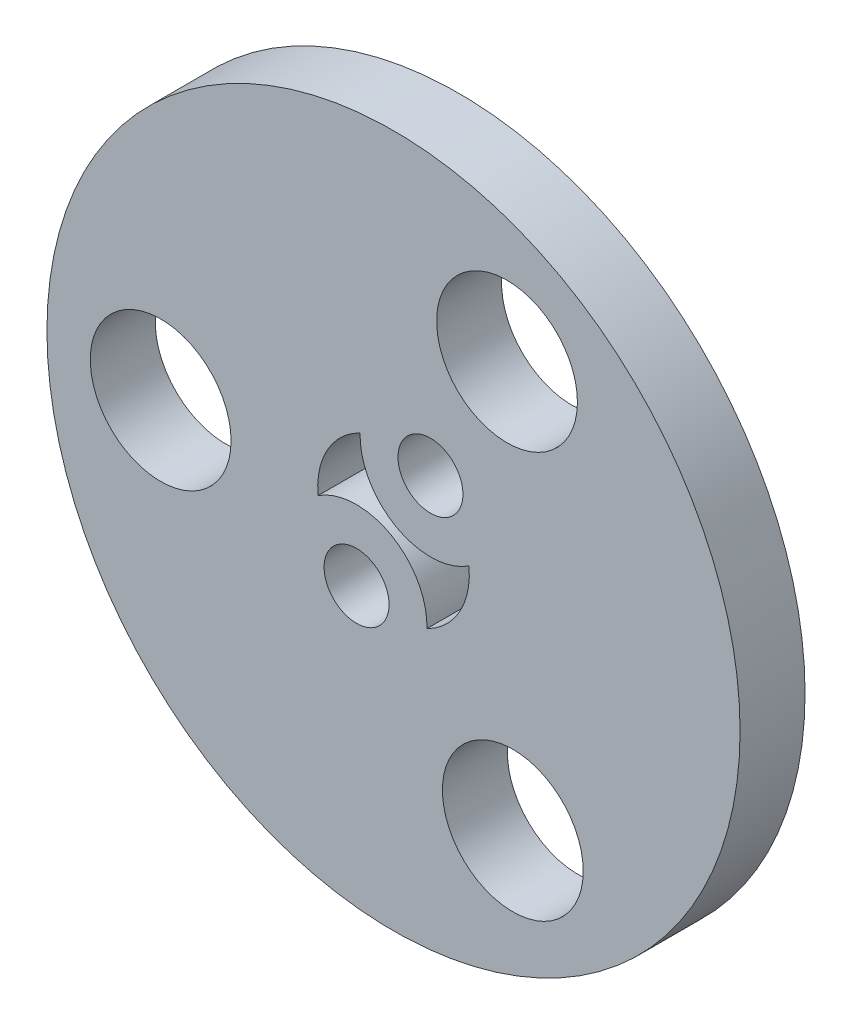
ISO-10303-21;
HEADER;
FILE_DESCRIPTION(('STEP AP214'),'2;1');
FILE_NAME('part.step','',(''),(''),'','','');
FILE_SCHEMA(('AUTOMOTIVE_DESIGN { 1 0 10303 214 1 1 1 1 }'));
ENDSEC;
DATA;
#1=APPLICATION_CONTEXT('core data for automotive mechanical design processes');
#2=APPLICATION_PROTOCOL_DEFINITION('international standard','automotive_design',2000,#1);
#3=PRODUCT_CONTEXT('',#1,'mechanical');
#4=PRODUCT('Part','Part','',(#3));
#5=PRODUCT_RELATED_PRODUCT_CATEGORY('part','',(#4));
#6=PRODUCT_DEFINITION_FORMATION('','',#4);
#7=PRODUCT_DEFINITION_CONTEXT('part definition',#1,'design');
#8=PRODUCT_DEFINITION('design','',#6,#7);
#9=PRODUCT_DEFINITION_SHAPE('','',#8);
#10=(LENGTH_UNIT() NAMED_UNIT(*) SI_UNIT(.MILLI.,.METRE.));
#11=(NAMED_UNIT(*) PLANE_ANGLE_UNIT() SI_UNIT($,.RADIAN.));
#12=(NAMED_UNIT(*) SI_UNIT($,.STERADIAN.) SOLID_ANGLE_UNIT());
#13=UNCERTAINTY_MEASURE_WITH_UNIT(LENGTH_MEASURE(1.E-05),#10,'distance_accuracy_value','');
#14=(GEOMETRIC_REPRESENTATION_CONTEXT(3) GLOBAL_UNCERTAINTY_ASSIGNED_CONTEXT((#13)) GLOBAL_UNIT_ASSIGNED_CONTEXT((#10,
#11,#12)) REPRESENTATION_CONTEXT('',''));
#15=CARTESIAN_POINT('',(0.,0.,0.));
#16=DIRECTION('',(0.,0.,1.));
#17=DIRECTION('',(1.,0.,0.));
#18=AXIS2_PLACEMENT_3D('',#15,#16,#17);
#19=CARTESIAN_POINT('',(0.,0.,3.));
#20=DIRECTION('',(0.,0.,1.));
#21=DIRECTION('',(1.,0.,0.));
#22=AXIS2_PLACEMENT_3D('',#19,#20,#21);
#23=PLANE('',#22);
#24=CARTESIAN_POINT('',(1.70619408974695,3.05596166993511,3.));
#25=DIRECTION('',(0.,0.,1.));
#26=DIRECTION('',(1.,0.,0.));
#27=AXIS2_PLACEMENT_3D('',#24,#25,#26);
#28=CIRCLE('',#27,1.5);
#29=CARTESIAN_POINT('',(3.20619408974695,3.05596166993511,3.));
#30=VERTEX_POINT('',#29);
#31=EDGE_CURVE('E103',#30,#30,#28,.T.);
#32=ORIENTED_EDGE('',*,*,#31,.F.);
#33=EDGE_LOOP('',(#32));
#34=FACE_BOUND('',#33,.T.);
#35=CARTESIAN_POINT('',(-10.7488865580884,-0.154718329055183,3.));
#36=DIRECTION('',(0.,0.,1.));
#37=DIRECTION('',(1.,0.,0.));
#38=AXIS2_PLACEMENT_3D('',#35,#36,#37);
#39=CIRCLE('',#38,3.25);
#40=CARTESIAN_POINT('',(-7.49888655808844,-0.154718329055183,3.));
#41=VERTEX_POINT('',#40);
#42=EDGE_CURVE('E119',#41,#41,#39,.T.);
#43=ORIENTED_EDGE('',*,*,#42,.F.);
#44=EDGE_LOOP('',(#43));
#45=FACE_BOUND('',#44,.T.);
#46=CARTESIAN_POINT('',(0.,0.,3.));
#47=DIRECTION('',(0.,0.,1.));
#48=DIRECTION('',(1.,0.,0.));
#49=AXIS2_PLACEMENT_3D('',#46,#47,#48);
#50=CIRCLE('',#49,16.);
#51=CARTESIAN_POINT('',(16.,0.,3.));
#52=VERTEX_POINT('',#51);
#53=EDGE_CURVE('E11',#52,#52,#50,.T.);
#54=ORIENTED_EDGE('',*,*,#53,.T.);
#55=EDGE_LOOP('',(#54));
#56=FACE_BOUND('',#55,.T.);
#57=CARTESIAN_POINT('',(5.5084332824371,-9.23144965717407,3.));
#58=DIRECTION('',(0.,0.,1.));
#59=DIRECTION('',(1.,0.,0.));
#60=AXIS2_PLACEMENT_3D('',#57,#58,#59);
#61=CIRCLE('',#60,3.25);
#62=CARTESIAN_POINT('',(8.7584332824371,-9.23144965717407,3.));
#63=VERTEX_POINT('',#62);
#64=EDGE_CURVE('E125',#63,#63,#61,.T.);
#65=ORIENTED_EDGE('',*,*,#64,.F.);
#66=EDGE_LOOP('',(#65));
#67=FACE_BOUND('',#66,.T.);
#68=CARTESIAN_POINT('',(5.24045327565135,9.38616798622926,3.));
#69=DIRECTION('',(0.,0.,1.));
#70=DIRECTION('',(1.,0.,0.));
#71=AXIS2_PLACEMENT_3D('',#68,#69,#70);
#72=CIRCLE('',#71,3.25);
#73=CARTESIAN_POINT('',(8.49045327565135,9.38616798622926,3.));
#74=VERTEX_POINT('',#73);
#75=EDGE_CURVE('E113',#74,#74,#72,.T.);
#76=ORIENTED_EDGE('',*,*,#75,.F.);
#77=EDGE_LOOP('',(#76));
#78=FACE_BOUND('',#77,.T.);
#79=CARTESIAN_POINT('',(-1.70619408974695,-3.05596166993511,3.));
#80=DIRECTION('',(0.,0.,-1.));
#81=DIRECTION('',(1.,0.,0.));
#82=AXIS2_PLACEMENT_3D('',#79,#80,#81);
#83=CIRCLE('',#82,3.25);
#84=CARTESIAN_POINT('',(-3.48390634074461,-0.335256034874079,3.));
#85=VERTEX_POINT('',#84);
#86=CARTESIAN_POINT('',(1.54267531006313,-3.14167994673576,3.));
#87=VERTEX_POINT('',#86);
#88=EDGE_CURVE('E82',#85,#87,#83,.T.);
#89=ORIENTED_EDGE('',*,*,#88,.F.);
#90=CARTESIAN_POINT('',(0.,0.,3.));
#91=DIRECTION('',(0.,0.,1.));
#92=DIRECTION('',(1.,0.,0.));
#93=AXIS2_PLACEMENT_3D('',#90,#91,#92);
#94=CIRCLE('',#93,3.5);
#95=CARTESIAN_POINT('',(-1.54267531006313,3.14167994673576,3.));
#96=VERTEX_POINT('',#95);
#97=EDGE_CURVE('E74',#96,#85,#94,.T.);
#98=ORIENTED_EDGE('',*,*,#97,.F.);
#99=CARTESIAN_POINT('',(1.70619408974695,3.05596166993511,3.));
#100=DIRECTION('',(0.,0.,-1.));
#101=DIRECTION('',(1.,0.,0.));
#102=AXIS2_PLACEMENT_3D('',#99,#100,#101);
#103=CIRCLE('',#102,3.25);
#104=CARTESIAN_POINT('',(3.48390634074461,0.335256034874077,3.));
#105=VERTEX_POINT('',#104);
#106=EDGE_CURVE('E97',#105,#96,#103,.T.);
#107=ORIENTED_EDGE('',*,*,#106,.F.);
#108=CARTESIAN_POINT('',(0.,0.,3.));
#109=DIRECTION('',(0.,0.,1.));
#110=DIRECTION('',(1.,0.,0.));
#111=AXIS2_PLACEMENT_3D('',#108,#109,#110);
#112=CIRCLE('',#111,3.5);
#113=EDGE_CURVE('E95',#87,#105,#112,.T.);
#114=ORIENTED_EDGE('',*,*,#113,.F.);
#115=EDGE_LOOP('',(#89,#98,#107,#114));
#116=FACE_BOUND('',#115,.T.);
#117=CARTESIAN_POINT('',(-1.70619408974695,-3.05596166993511,3.));
#118=DIRECTION('',(0.,0.,1.));
#119=DIRECTION('',(1.,0.,0.));
#120=AXIS2_PLACEMENT_3D('',#117,#118,#119);
#121=CIRCLE('',#120,1.5);
#122=CARTESIAN_POINT('',(-0.206194089746952,-3.05596166993511,3.));
#123=VERTEX_POINT('',#122);
#124=EDGE_CURVE('E198',#123,#123,#121,.T.);
#125=ORIENTED_EDGE('',*,*,#124,.F.);
#126=EDGE_LOOP('',(#125));
#127=FACE_BOUND('',#126,.T.);
#128=ADVANCED_FACE('F33',(#34,#45,#56,#67,#78,#116,#127),#23,.T.);
#129=CARTESIAN_POINT('',(0.,0.,0.));
#130=DIRECTION('',(0.,0.,1.));
#131=DIRECTION('',(1.,0.,0.));
#132=AXIS2_PLACEMENT_3D('',#129,#130,#131);
#133=PLANE('',#132);
#134=CARTESIAN_POINT('',(5.24045327565135,9.38616798622926,0.));
#135=DIRECTION('',(0.,0.,1.));
#136=DIRECTION('',(1.,0.,0.));
#137=AXIS2_PLACEMENT_3D('',#134,#135,#136);
#138=CIRCLE('',#137,3.25);
#139=CARTESIAN_POINT('',(8.49045327565135,9.38616798622926,0.));
#140=VERTEX_POINT('',#139);
#141=EDGE_CURVE('E90',#140,#140,#138,.T.);
#142=ORIENTED_EDGE('',*,*,#141,.T.);
#143=EDGE_LOOP('',(#142));
#144=FACE_BOUND('',#143,.T.);
#145=CARTESIAN_POINT('',(-10.7488865580884,-0.154718329055183,0.));
#146=DIRECTION('',(0.,0.,1.));
#147=DIRECTION('',(1.,0.,0.));
#148=AXIS2_PLACEMENT_3D('',#145,#146,#147);
#149=CIRCLE('',#148,3.25);
#150=CARTESIAN_POINT('',(-7.49888655808844,-0.154718329055183,0.));
#151=VERTEX_POINT('',#150);
#152=EDGE_CURVE('E116',#151,#151,#149,.T.);
#153=ORIENTED_EDGE('',*,*,#152,.T.);
#154=EDGE_LOOP('',(#153));
#155=FACE_BOUND('',#154,.T.);
#156=CARTESIAN_POINT('',(5.5084332824371,-9.23144965717407,0.));
#157=DIRECTION('',(0.,0.,1.));
#158=DIRECTION('',(1.,0.,0.));
#159=AXIS2_PLACEMENT_3D('',#156,#157,#158);
#160=CIRCLE('',#159,3.25);
#161=CARTESIAN_POINT('',(8.7584332824371,-9.23144965717407,0.));
#162=VERTEX_POINT('',#161);
#163=EDGE_CURVE('E122',#162,#162,#160,.T.);
#164=ORIENTED_EDGE('',*,*,#163,.T.);
#165=EDGE_LOOP('',(#164));
#166=FACE_BOUND('',#165,.T.);
#167=CARTESIAN_POINT('',(0.,0.,0.));
#168=DIRECTION('',(0.,0.,1.));
#169=DIRECTION('',(1.,0.,0.));
#170=AXIS2_PLACEMENT_3D('',#167,#168,#169);
#171=CIRCLE('',#170,16.);
#172=CARTESIAN_POINT('',(16.,0.,0.));
#173=VERTEX_POINT('',#172);
#174=EDGE_CURVE('E37',#173,#173,#171,.T.);
#175=ORIENTED_EDGE('',*,*,#174,.F.);
#176=EDGE_LOOP('',(#175));
#177=FACE_BOUND('',#176,.T.);
#178=CARTESIAN_POINT('',(0.,0.,0.));
#179=DIRECTION('',(0.,0.,1.));
#180=DIRECTION('',(1.,0.,0.));
#181=AXIS2_PLACEMENT_3D('',#178,#179,#180);
#182=CIRCLE('',#181,3.5);
#183=CARTESIAN_POINT('',(-1.54267531006313,3.14167994673576,0.));
#184=VERTEX_POINT('',#183);
#185=CARTESIAN_POINT('',(-3.48390634074461,-0.335256034874079,0.));
#186=VERTEX_POINT('',#185);
#187=EDGE_CURVE('E56',#184,#186,#182,.T.);
#188=ORIENTED_EDGE('',*,*,#187,.T.);
#189=CARTESIAN_POINT('',(-1.70619408974695,-3.05596166993511,0.));
#190=DIRECTION('',(0.,0.,-1.));
#191=DIRECTION('',(1.,0.,0.));
#192=AXIS2_PLACEMENT_3D('',#189,#190,#191);
#193=CIRCLE('',#192,3.25);
#194=CARTESIAN_POINT('',(1.54267531006313,-3.14167994673576,0.));
#195=VERTEX_POINT('',#194);
#196=EDGE_CURVE('E89',#186,#195,#193,.T.);
#197=ORIENTED_EDGE('',*,*,#196,.T.);
#198=CARTESIAN_POINT('',(0.,0.,0.));
#199=DIRECTION('',(0.,0.,1.));
#200=DIRECTION('',(1.,0.,0.));
#201=AXIS2_PLACEMENT_3D('',#198,#199,#200);
#202=CIRCLE('',#201,3.5);
#203=CARTESIAN_POINT('',(3.48390634074461,0.335256034874077,0.));
#204=VERTEX_POINT('',#203);
#205=EDGE_CURVE('E105',#195,#204,#202,.T.);
#206=ORIENTED_EDGE('',*,*,#205,.T.);
#207=CARTESIAN_POINT('',(1.70619408974695,3.05596166993511,0.));
#208=DIRECTION('',(0.,0.,-1.));
#209=DIRECTION('',(1.,0.,0.));
#210=AXIS2_PLACEMENT_3D('',#207,#208,#209);
#211=CIRCLE('',#210,3.25);
#212=EDGE_CURVE('E83',#204,#184,#211,.T.);
#213=ORIENTED_EDGE('',*,*,#212,.T.);
#214=EDGE_LOOP('',(#188,#197,#206,#213));
#215=FACE_BOUND('',#214,.T.);
#216=CARTESIAN_POINT('',(1.70619408974695,3.05596166993511,0.));
#217=DIRECTION('',(0.,0.,1.));
#218=DIRECTION('',(1.,0.,0.));
#219=AXIS2_PLACEMENT_3D('',#216,#217,#218);
#220=CIRCLE('',#219,1.5);
#221=CARTESIAN_POINT('',(3.20619408974695,3.05596166993511,0.));
#222=VERTEX_POINT('',#221);
#223=EDGE_CURVE('E204',#222,#222,#220,.T.);
#224=ORIENTED_EDGE('',*,*,#223,.T.);
#225=EDGE_LOOP('',(#224));
#226=FACE_BOUND('',#225,.T.);
#227=CARTESIAN_POINT('',(-1.70619408974695,-3.05596166993511,0.));
#228=DIRECTION('',(0.,0.,1.));
#229=DIRECTION('',(1.,0.,0.));
#230=AXIS2_PLACEMENT_3D('',#227,#228,#229);
#231=CIRCLE('',#230,1.5);
#232=CARTESIAN_POINT('',(-0.206194089746952,-3.05596166993511,0.));
#233=VERTEX_POINT('',#232);
#234=EDGE_CURVE('E201',#233,#233,#231,.T.);
#235=ORIENTED_EDGE('',*,*,#234,.T.);
#236=EDGE_LOOP('',(#235));
#237=FACE_BOUND('',#236,.T.);
#238=ADVANCED_FACE('F131',(#144,#155,#166,#177,#215,#226,#237),#133,.F.);
#239=CARTESIAN_POINT('',(0.,0.,3.));
#240=DIRECTION('',(0.,0.,-1.));
#241=DIRECTION('',(-1.,0.,0.));
#242=AXIS2_PLACEMENT_3D('',#239,#240,#241);
#243=CYLINDRICAL_SURFACE('',#242,16.);
#244=ORIENTED_EDGE('',*,*,#53,.F.);
#245=EDGE_LOOP('',(#244));
#246=FACE_BOUND('',#245,.T.);
#247=ORIENTED_EDGE('',*,*,#174,.T.);
#248=EDGE_LOOP('',(#247));
#249=FACE_BOUND('',#248,.T.);
#250=ADVANCED_FACE('F35',(#246,#249),#243,.T.);
#251=CARTESIAN_POINT('',(5.5084332824371,-9.23144965717407,3.));
#252=DIRECTION('',(0.,0.,-1.));
#253=DIRECTION('',(-1.,0.,0.));
#254=AXIS2_PLACEMENT_3D('',#251,#252,#253);
#255=CYLINDRICAL_SURFACE('',#254,3.25);
#256=ORIENTED_EDGE('',*,*,#64,.T.);
#257=EDGE_LOOP('',(#256));
#258=FACE_BOUND('',#257,.T.);
#259=ORIENTED_EDGE('',*,*,#163,.F.);
#260=EDGE_LOOP('',(#259));
#261=FACE_BOUND('',#260,.T.);
#262=ADVANCED_FACE('F134',(#258,#261),#255,.F.);
#263=CARTESIAN_POINT('',(-10.7488865580884,-0.154718329055183,3.));
#264=DIRECTION('',(0.,0.,-1.));
#265=DIRECTION('',(-1.,0.,0.));
#266=AXIS2_PLACEMENT_3D('',#263,#264,#265);
#267=CYLINDRICAL_SURFACE('',#266,3.25);
#268=ORIENTED_EDGE('',*,*,#42,.T.);
#269=EDGE_LOOP('',(#268));
#270=FACE_BOUND('',#269,.T.);
#271=ORIENTED_EDGE('',*,*,#152,.F.);
#272=EDGE_LOOP('',(#271));
#273=FACE_BOUND('',#272,.T.);
#274=ADVANCED_FACE('F136',(#270,#273),#267,.F.);
#275=CARTESIAN_POINT('',(5.24045327565135,9.38616798622926,3.));
#276=DIRECTION('',(0.,0.,-1.));
#277=DIRECTION('',(-1.,0.,0.));
#278=AXIS2_PLACEMENT_3D('',#275,#276,#277);
#279=CYLINDRICAL_SURFACE('',#278,3.25);
#280=ORIENTED_EDGE('',*,*,#75,.T.);
#281=EDGE_LOOP('',(#280));
#282=FACE_BOUND('',#281,.T.);
#283=ORIENTED_EDGE('',*,*,#141,.F.);
#284=EDGE_LOOP('',(#283));
#285=FACE_BOUND('',#284,.T.);
#286=ADVANCED_FACE('F143',(#282,#285),#279,.F.);
#287=CARTESIAN_POINT('',(0.,0.,3.));
#288=DIRECTION('',(0.,0.,-1.));
#289=DIRECTION('',(-1.,0.,0.));
#290=AXIS2_PLACEMENT_3D('',#287,#288,#289);
#291=CYLINDRICAL_SURFACE('',#290,3.5);
#292=ORIENTED_EDGE('',*,*,#187,.F.);
#293=DIRECTION('',(0.,0.,-1.));
#294=VECTOR('',#293,1.);
#295=CARTESIAN_POINT('',(-1.54267531006313,3.14167994673576,3.));
#296=LINE('',#295,#294);
#297=EDGE_CURVE('E78',#96,#184,#296,.T.);
#298=ORIENTED_EDGE('',*,*,#297,.F.);
#299=ORIENTED_EDGE('',*,*,#97,.T.);
#300=DIRECTION('',(0.,0.,-1.));
#301=VECTOR('',#300,1.);
#302=CARTESIAN_POINT('',(-3.48390634074461,-0.335256034874079,3.));
#303=LINE('',#302,#301);
#304=EDGE_CURVE('E77',#85,#186,#303,.T.);
#305=ORIENTED_EDGE('',*,*,#304,.T.);
#306=EDGE_LOOP('',(#292,#298,#299,#305));
#307=FACE_BOUND('',#306,.T.);
#308=ADVANCED_FACE('F76',(#307),#291,.F.);
#309=CARTESIAN_POINT('',(-1.70619408974695,-3.05596166993511,3.));
#310=DIRECTION('',(0.,0.,-1.));
#311=DIRECTION('',(-1.,0.,0.));
#312=AXIS2_PLACEMENT_3D('',#309,#310,#311);
#313=CYLINDRICAL_SURFACE('',#312,3.25);
#314=ORIENTED_EDGE('',*,*,#196,.F.);
#315=ORIENTED_EDGE('',*,*,#304,.F.);
#316=ORIENTED_EDGE('',*,*,#88,.T.);
#317=DIRECTION('',(0.,0.,-1.));
#318=VECTOR('',#317,1.);
#319=CARTESIAN_POINT('',(1.54267531006313,-3.14167994673576,3.));
#320=LINE('',#319,#318);
#321=EDGE_CURVE('E91',#87,#195,#320,.T.);
#322=ORIENTED_EDGE('',*,*,#321,.T.);
#323=EDGE_LOOP('',(#314,#315,#316,#322));
#324=FACE_BOUND('',#323,.T.);
#325=ADVANCED_FACE('F86',(#324),#313,.T.);
#326=CARTESIAN_POINT('',(0.,0.,3.));
#327=DIRECTION('',(0.,0.,-1.));
#328=DIRECTION('',(-1.,0.,0.));
#329=AXIS2_PLACEMENT_3D('',#326,#327,#328);
#330=CYLINDRICAL_SURFACE('',#329,3.5);
#331=ORIENTED_EDGE('',*,*,#205,.F.);
#332=ORIENTED_EDGE('',*,*,#321,.F.);
#333=ORIENTED_EDGE('',*,*,#113,.T.);
#334=DIRECTION('',(0.,0.,-1.));
#335=VECTOR('',#334,1.);
#336=CARTESIAN_POINT('',(3.48390634074461,0.335256034874077,3.));
#337=LINE('',#336,#335);
#338=EDGE_CURVE('E48',#105,#204,#337,.T.);
#339=ORIENTED_EDGE('',*,*,#338,.T.);
#340=EDGE_LOOP('',(#331,#332,#333,#339));
#341=FACE_BOUND('',#340,.T.);
#342=ADVANCED_FACE('F179',(#341),#330,.F.);
#343=CARTESIAN_POINT('',(1.70619408974695,3.05596166993511,3.));
#344=DIRECTION('',(0.,0.,-1.));
#345=DIRECTION('',(-1.,0.,0.));
#346=AXIS2_PLACEMENT_3D('',#343,#344,#345);
#347=CYLINDRICAL_SURFACE('',#346,3.25);
#348=ORIENTED_EDGE('',*,*,#212,.F.);
#349=ORIENTED_EDGE('',*,*,#338,.F.);
#350=ORIENTED_EDGE('',*,*,#106,.T.);
#351=ORIENTED_EDGE('',*,*,#297,.T.);
#352=EDGE_LOOP('',(#348,#349,#350,#351));
#353=FACE_BOUND('',#352,.T.);
#354=ADVANCED_FACE('F182',(#353),#347,.T.);
#355=CARTESIAN_POINT('',(1.70619408974695,3.05596166993511,3.));
#356=DIRECTION('',(0.,0.,-1.));
#357=DIRECTION('',(-1.,0.,0.));
#358=AXIS2_PLACEMENT_3D('',#355,#356,#357);
#359=CYLINDRICAL_SURFACE('',#358,1.5);
#360=ORIENTED_EDGE('',*,*,#31,.T.);
#361=EDGE_LOOP('',(#360));
#362=FACE_BOUND('',#361,.T.);
#363=ORIENTED_EDGE('',*,*,#223,.F.);
#364=EDGE_LOOP('',(#363));
#365=FACE_BOUND('',#364,.T.);
#366=ADVANCED_FACE('F186',(#362,#365),#359,.F.);
#367=CARTESIAN_POINT('',(-1.70619408974695,-3.05596166993511,3.));
#368=DIRECTION('',(0.,0.,-1.));
#369=DIRECTION('',(-1.,0.,0.));
#370=AXIS2_PLACEMENT_3D('',#367,#368,#369);
#371=CYLINDRICAL_SURFACE('',#370,1.5);
#372=ORIENTED_EDGE('',*,*,#124,.T.);
#373=EDGE_LOOP('',(#372));
#374=FACE_BOUND('',#373,.T.);
#375=ORIENTED_EDGE('',*,*,#234,.F.);
#376=EDGE_LOOP('',(#375));
#377=FACE_BOUND('',#376,.T.);
#378=ADVANCED_FACE('F189',(#374,#377),#371,.F.);
#379=CLOSED_SHELL('',(#128,#238,#250,#262,#274,#286,#308,#325,#342,#354,#366,#378));
#380=MANIFOLD_SOLID_BREP('B2',#379);
#381=ADVANCED_BREP_SHAPE_REPRESENTATION('',(#18,#380),#14);
#382=SHAPE_DEFINITION_REPRESENTATION(#9,#381);
ENDSEC;
END-ISO-10303-21;
